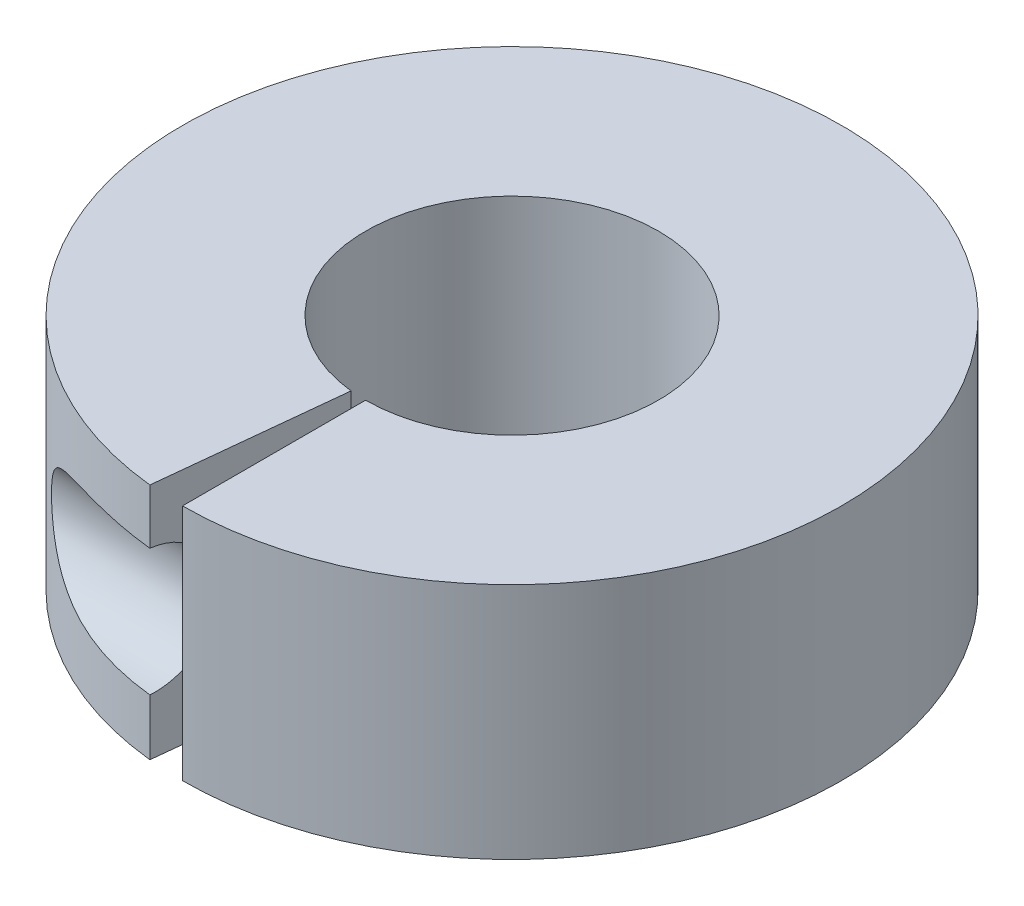
ISO-10303-21;
HEADER;
FILE_DESCRIPTION(('STEP AP214'),'2;1');
FILE_NAME('part.step','',(''),(''),'','','');
FILE_SCHEMA(('AUTOMOTIVE_DESIGN { 1 0 10303 214 1 1 1 1 }'));
ENDSEC;
DATA;
#1=APPLICATION_CONTEXT('core data for automotive mechanical design processes');
#2=APPLICATION_PROTOCOL_DEFINITION('international standard','automotive_design',2000,#1);
#3=PRODUCT_CONTEXT('',#1,'mechanical');
#4=PRODUCT('Part','Part','',(#3));
#5=PRODUCT_RELATED_PRODUCT_CATEGORY('part','',(#4));
#6=PRODUCT_DEFINITION_FORMATION('','',#4);
#7=PRODUCT_DEFINITION_CONTEXT('part definition',#1,'design');
#8=PRODUCT_DEFINITION('design','',#6,#7);
#9=PRODUCT_DEFINITION_SHAPE('','',#8);
#10=(LENGTH_UNIT() NAMED_UNIT(*) SI_UNIT(.MILLI.,.METRE.));
#11=(NAMED_UNIT(*) PLANE_ANGLE_UNIT() SI_UNIT($,.RADIAN.));
#12=(NAMED_UNIT(*) SI_UNIT($,.STERADIAN.) SOLID_ANGLE_UNIT());
#13=UNCERTAINTY_MEASURE_WITH_UNIT(LENGTH_MEASURE(1.E-05),#10,'distance_accuracy_value','');
#14=(GEOMETRIC_REPRESENTATION_CONTEXT(3) GLOBAL_UNCERTAINTY_ASSIGNED_CONTEXT((#13)) GLOBAL_UNIT_ASSIGNED_CONTEXT((#10,
#11,#12)) REPRESENTATION_CONTEXT('',''));
#15=CARTESIAN_POINT('',(0.,0.,0.));
#16=DIRECTION('',(0.,0.,1.));
#17=DIRECTION('',(1.,0.,0.));
#18=AXIS2_PLACEMENT_3D('',#15,#16,#17);
#19=CARTESIAN_POINT('',(0.,10.31875,0.));
#20=DIRECTION('',(0.,1.,0.));
#21=DIRECTION('',(0.,0.,1.));
#22=AXIS2_PLACEMENT_3D('',#19,#20,#21);
#23=PLANE('',#22);
#24=DIRECTION('',(-0.104528463267653,0.,0.994521895368273));
#25=VECTOR('',#24,1.);
#26=CARTESIAN_POINT('',(-0.6637557417496,10.31875,6.31521403558853));
#27=LINE('',#26,#25);
#28=CARTESIAN_POINT('',(-0.663755741749604,10.31875,6.31521403558853));
#29=VERTEX_POINT('',#28);
#30=CARTESIAN_POINT('',(-1.4934504189366,10.31875,14.2092315800742));
#31=VERTEX_POINT('',#30);
#32=EDGE_CURVE('E104',#29,#31,#27,.T.);
#33=ORIENTED_EDGE('',*,*,#32,.F.);
#34=CARTESIAN_POINT('',(0.,10.31875,0.));
#35=DIRECTION('',(0.,1.,0.));
#36=DIRECTION('',(0.,0.,1.));
#37=AXIS2_PLACEMENT_3D('',#34,#35,#36);
#38=CIRCLE('',#37,6.35);
#39=CARTESIAN_POINT('',(0.,10.31875,6.35));
#40=VERTEX_POINT('',#39);
#41=EDGE_CURVE('E109',#40,#29,#38,.T.);
#42=ORIENTED_EDGE('',*,*,#41,.F.);
#43=DIRECTION('',(0.,0.,-1.));
#44=VECTOR('',#43,1.);
#45=CARTESIAN_POINT('',(0.,10.31875,6.35));
#46=LINE('',#45,#44);
#47=CARTESIAN_POINT('',(0.,10.31875,14.2875));
#48=VERTEX_POINT('',#47);
#49=EDGE_CURVE('E205',#48,#40,#46,.T.);
#50=ORIENTED_EDGE('',*,*,#49,.F.);
#51=CARTESIAN_POINT('',(0.,10.31875,0.));
#52=DIRECTION('',(0.,1.,0.));
#53=DIRECTION('',(0.,0.,1.));
#54=AXIS2_PLACEMENT_3D('',#51,#52,#53);
#55=CIRCLE('',#54,14.2875);
#56=EDGE_CURVE('E89',#48,#31,#55,.T.);
#57=ORIENTED_EDGE('',*,*,#56,.T.);
#58=EDGE_LOOP('',(#33,#42,#50,#57));
#59=FACE_BOUND('',#58,.T.);
#60=ADVANCED_FACE('F39',(#59),#23,.T.);
#61=CARTESIAN_POINT('',(0.,0.,0.));
#62=DIRECTION('',(0.,1.,0.));
#63=DIRECTION('',(0.,0.,1.));
#64=AXIS2_PLACEMENT_3D('',#61,#62,#63);
#65=PLANE('',#64);
#66=CARTESIAN_POINT('',(0.,0.,0.));
#67=DIRECTION('',(0.,1.,0.));
#68=DIRECTION('',(0.,0.,1.));
#69=AXIS2_PLACEMENT_3D('',#66,#67,#68);
#70=CIRCLE('',#69,6.35);
#71=CARTESIAN_POINT('',(0.,0.,6.35));
#72=VERTEX_POINT('',#71);
#73=CARTESIAN_POINT('',(-0.663755741749604,0.,6.31521403558853));
#74=VERTEX_POINT('',#73);
#75=EDGE_CURVE('E115',#72,#74,#70,.T.);
#76=ORIENTED_EDGE('',*,*,#75,.T.);
#77=DIRECTION('',(-0.104528463267653,0.,0.994521895368273));
#78=VECTOR('',#77,1.);
#79=CARTESIAN_POINT('',(-0.6637557417496,0.,6.31521403558853));
#80=LINE('',#79,#78);
#81=CARTESIAN_POINT('',(-1.4934504189366,0.,14.2092315800742));
#82=VERTEX_POINT('',#81);
#83=EDGE_CURVE('E103',#74,#82,#80,.T.);
#84=ORIENTED_EDGE('',*,*,#83,.T.);
#85=CARTESIAN_POINT('',(0.,0.,0.));
#86=DIRECTION('',(0.,1.,0.));
#87=DIRECTION('',(0.,0.,1.));
#88=AXIS2_PLACEMENT_3D('',#85,#86,#87);
#89=CIRCLE('',#88,14.2875);
#90=CARTESIAN_POINT('',(0.,0.,14.2875));
#91=VERTEX_POINT('',#90);
#92=EDGE_CURVE('E87',#91,#82,#89,.T.);
#93=ORIENTED_EDGE('',*,*,#92,.F.);
#94=DIRECTION('',(0.,0.,-1.));
#95=VECTOR('',#94,1.);
#96=CARTESIAN_POINT('',(0.,0.,6.35));
#97=LINE('',#96,#95);
#98=EDGE_CURVE('E95',#91,#72,#97,.T.);
#99=ORIENTED_EDGE('',*,*,#98,.T.);
#100=EDGE_LOOP('',(#76,#84,#93,#99));
#101=FACE_BOUND('',#100,.T.);
#102=ADVANCED_FACE('F107',(#101),#65,.F.);
#103=CARTESIAN_POINT('',(0.,10.31875,0.));
#104=DIRECTION('',(0.,-1.,0.));
#105=DIRECTION('',(0.,0.,-1.));
#106=AXIS2_PLACEMENT_3D('',#103,#104,#105);
#107=CYLINDRICAL_SURFACE('',#106,14.2875);
#108=ORIENTED_EDGE('',*,*,#92,.T.);
#109=DIRECTION('',(0.,1.,0.));
#110=VECTOR('',#109,1.);
#111=CARTESIAN_POINT('',(-1.4934504189366,0.,14.2092315800742));
#112=LINE('',#111,#110);
#113=CARTESIAN_POINT('',(-1.4934504189366,2.43630016177887,14.2092315800742));
#114=VERTEX_POINT('',#113);
#115=EDGE_CURVE('E188',#82,#114,#112,.T.);
#116=ORIENTED_EDGE('',*,*,#115,.T.);
#117=CARTESIAN_POINT('',(0.,2.43518799899639,14.2875));
#118=CARTESIAN_POINT('',(-0.196336505388267,2.43522626136705,14.287502459682));
#119=CARTESIAN_POINT('',(-0.392672827958571,2.43518932541999,14.2834530510071));
#120=CARTESIAN_POINT('',(-0.78501652227577,2.43524017041919,14.2672680045718));
#121=CARTESIAN_POINT('',(-0.981023886143076,2.43532795431138,14.2551321758114));
#122=CARTESIAN_POINT('',(-1.37284324929985,2.43590406994694,14.2227528361699));
#123=CARTESIAN_POINT('',(-1.56865363989008,2.43639336630433,14.2024898602133));
#124=CARTESIAN_POINT('',(-1.95926367728492,2.43832192242183,14.1538925677908));
#125=CARTESIAN_POINT('',(-2.15406333622991,2.43976117074486,14.1255583485022));
#126=CARTESIAN_POINT('',(-2.54854796589378,2.44440858167978,14.0598299201523));
#127=CARTESIAN_POINT('',(-2.74818879080997,2.44767209635289,14.0221738527044));
#128=CARTESIAN_POINT('',(-3.14561748772692,2.45707347706137,13.9383996848902));
#129=CARTESIAN_POINT('',(-3.34340541772103,2.46321125282725,13.8922818503031));
#130=CARTESIAN_POINT('',(-3.73642488196423,2.47968376664615,13.7917682153464));
#131=CARTESIAN_POINT('',(-3.9316594125193,2.49001302330708,13.737383284109));
#132=CARTESIAN_POINT('',(-4.31924990619762,2.51649161637549,13.6204879857777));
#133=CARTESIAN_POINT('',(-4.51160651921118,2.53263961748689,13.5579794849978));
#134=CARTESIAN_POINT('',(-4.88974910509283,2.57241722224282,13.426185279214));
#135=CARTESIAN_POINT('',(-5.0755909538197,2.59592319740029,13.3570237800854));
#136=CARTESIAN_POINT('',(-5.44303381265776,2.65280691603915,13.2115508526591));
#137=CARTESIAN_POINT('',(-5.62463345703703,2.68618779263965,13.1352371603641));
#138=CARTESIAN_POINT('',(-5.98046592448732,2.76525875550508,12.9770644878873));
#139=CARTESIAN_POINT('',(-6.1547543061401,2.81082223658022,12.8952686873311));
#140=CARTESIAN_POINT('',(-6.49588522513086,2.91775987322536,12.7268300689859));
#141=CARTESIAN_POINT('',(-6.66273605989191,2.97911586487212,12.6401929085734));
#142=CARTESIAN_POINT('',(-6.95537099722593,3.10817165851765,12.4810930886774));
#143=CARTESIAN_POINT('',(-7.08290819449733,3.17241652198592,12.4090868513379));
#144=CARTESIAN_POINT('',(-7.32933120367261,3.31672312864701,12.2651503291084));
#145=CARTESIAN_POINT('',(-7.4482012937135,3.39681268245593,12.1932204045825));
#146=CARTESIAN_POINT('',(-7.6749191139143,3.57645699453041,12.0518173538936));
#147=CARTESIAN_POINT('',(-7.78262642033859,3.67622237428722,11.9823813806142));
#148=CARTESIAN_POINT('',(-7.98001744441912,3.89684556298222,11.8518310834624));
#149=CARTESIAN_POINT('',(-8.06975729245826,4.01763540872937,11.7906910422899));
#150=CARTESIAN_POINT('',(-8.19631308816605,4.23284609290068,11.702853805896));
#151=CARTESIAN_POINT('',(-8.2405457092596,4.32107621637753,11.6716855593509));
#152=CARTESIAN_POINT('',(-8.31662006383607,4.50514362783557,11.6176013892305));
#153=CARTESIAN_POINT('',(-8.34847060466156,4.60097545011222,11.594679600839));
#154=CARTESIAN_POINT('',(-8.39795477622407,4.7988834548608,11.5588916653572));
#155=CARTESIAN_POINT('',(-8.41548385865771,4.90099980613356,11.5460994860597));
#156=CARTESIAN_POINT('',(-8.43457037291047,5.10750298867355,11.5321651233197));
#157=CARTESIAN_POINT('',(-8.43613504331435,5.21188876941788,11.5310176599307));
#158=CARTESIAN_POINT('',(-8.42387288596192,5.40827888878753,11.5399763143496));
#159=CARTESIAN_POINT('',(-8.41162849949786,5.50044269667703,11.5489254584342));
#160=CARTESIAN_POINT('',(-8.37503811039647,5.68101029638654,11.5754869483903));
#161=CARTESIAN_POINT('',(-8.35069068633239,5.76941364523978,11.5931003118182));
#162=CARTESIAN_POINT('',(-8.29043013835937,5.94291589290777,11.6362716727227));
#163=CARTESIAN_POINT('',(-8.25422028466641,6.02785938277428,11.6620328395599));
#164=CARTESIAN_POINT('',(-8.17216965768959,6.190669723827,11.7196766461268));
#165=CARTESIAN_POINT('',(-8.1263241289619,6.26853305349448,11.7515623077745));
#166=CARTESIAN_POINT('',(-7.99732172518709,6.46036389916572,11.8399588284851));
#167=CARTESIAN_POINT('',(-7.90807468609977,6.56864627541153,11.8999265074418));
#168=CARTESIAN_POINT('',(-7.71493336883167,6.76705657995545,12.0260477580427));
#169=CARTESIAN_POINT('',(-7.61100136317461,6.85713624739186,12.0922171103158));
#170=CARTESIAN_POINT('',(-7.41451466873901,7.00459136347475,12.2134433510683));
#171=CARTESIAN_POINT('',(-7.32385076681926,7.06490347373108,12.2680713955341));
#172=CARTESIAN_POINT('',(-7.13716457640268,7.17636632289021,12.3776109899024));
#173=CARTESIAN_POINT('',(-7.04113893073328,7.22751123558598,12.432522697442));
#174=CARTESIAN_POINT('',(-6.84475562839349,7.32180799525252,12.5417151753006));
#175=CARTESIAN_POINT('',(-6.74439275171775,7.36494986019274,12.5959950795821));
#176=CARTESIAN_POINT('',(-6.54022139026463,7.444233763821,12.7032075188554));
#177=CARTESIAN_POINT('',(-6.43641160439428,7.48037312329031,12.756139531431));
#178=CARTESIAN_POINT('',(-6.13413848986329,7.57551147110742,12.9055495879459));
#179=CARTESIAN_POINT('',(-5.93213463037887,7.62693541734715,12.9997160869292));
#180=CARTESIAN_POINT('',(-5.52101452650004,7.71378657865407,13.1795887098799));
#181=CARTESIAN_POINT('',(-5.3118921498803,7.74919960591378,13.2652872777971));
#182=CARTESIAN_POINT('',(-4.88744699158083,7.80817193134774,13.4274852847809));
#183=CARTESIAN_POINT('',(-4.67210092086994,7.83167823156422,13.5039424609511));
#184=CARTESIAN_POINT('',(-4.23736386568459,7.86986049854964,13.6466019573843));
#185=CARTESIAN_POINT('',(-4.01797388949458,7.88453863659105,13.7128067962166));
#186=CARTESIAN_POINT('',(-3.64176175379775,7.90422242719199,13.8165178819876));
#187=CARTESIAN_POINT('',(-3.4857482614963,7.91080660907996,13.8567015983683));
#188=CARTESIAN_POINT('',(-3.17236463621944,7.92163794769589,13.9317880626581));
#189=CARTESIAN_POINT('',(-3.01499442974293,7.92588497698832,13.9666905225262));
#190=CARTESIAN_POINT('',(-2.69907073376496,7.93267672950823,14.0311680440448));
#191=CARTESIAN_POINT('',(-2.54051681592174,7.93522080297127,14.0607410691029));
#192=CARTESIAN_POINT('',(-2.22248421752124,7.93913220186248,14.1145042032177));
#193=CARTESIAN_POINT('',(-2.06300553110335,7.94049951982487,14.1386942781222));
#194=CARTESIAN_POINT('',(-1.74545903136191,7.94247439114498,14.181373294899));
#195=CARTESIAN_POINT('',(-1.58740095039631,7.94309188035417,14.1999342920272));
#196=CARTESIAN_POINT('',(-1.270751568253,7.94391951785905,14.2317661351393));
#197=CARTESIAN_POINT('',(-1.11216026556169,7.94412966499747,14.2450369660937));
#198=CARTESIAN_POINT('',(-0.794728793582914,7.94437747144386,14.2662660404374));
#199=CARTESIAN_POINT('',(-0.63588886104726,7.94441524578336,14.2742278237442));
#200=CARTESIAN_POINT('',(-0.318032638558107,7.94443710884899,14.284845318998));
#201=CARTESIAN_POINT('',(-0.159016349589901,7.94442119787355,14.2875010604415));
#202=CARTESIAN_POINT('',(0.,7.94443768817688,14.2875));
#203=B_SPLINE_CURVE_WITH_KNOTS('',3,(#117,#118,#119,#120,#121,#122,#123,#124,#125,#126,#127,
#128,#129,#130,#131,#132,#133,#134,#135,#136,#137,#138,#139,#140,#141,#142,#143,#144,#145,#146,
#147,#148,#149,#150,#151,#152,#153,#154,#155,#156,#157,#158,#159,#160,#161,#162,#163,#164,#165,
#166,#167,#168,#169,#170,#171,#172,#173,#174,#175,#176,#177,#178,#179,#180,#181,#182,#183,#184,
#185,#186,#187,#188,#189,#190,#191,#192,#193,#194,#195,#196,#197,#198,#199,#200,#201,#202),
.UNSPECIFIED.,.F.,.F.,(4,2,2,2,2,2,2,2,2,2,2,2,2,2,2,2,2,2,2,2,2,2,2,2,2,2,2,2,2,2,2,2,2,2,2,2,
2,2,2,2,2,2,4),(0.,0.58896747626181,1.17794886434074,1.76834940837035,2.35874284431726,
2.96810654908485,3.57745111736593,4.1860013727515,4.79441206575853,5.39310424187376,
5.99198657577533,6.58487201009108,7.17707855459499,7.65607539541888,8.1359205526238,
8.62121219048108,9.10496327240265,9.41433114366668,9.72347855794715,10.0348631115602,
10.3461064708902,10.6250084312054,10.9039431545687,11.1904691500013,11.4771368865431,
11.9323322827792,12.3887191461196,12.753693198777,13.1188983942921,13.4845560839238,
13.8503534022631,14.535388524127,15.2210294943104,15.9096960739929,16.5981932078885,
17.0818096968728,17.5654525529112,18.0492798383259,18.5331101933022,19.0104568726692,
19.4878049081715,19.9648343428608,20.4418611257071),.UNSPECIFIED.);
#204=CARTESIAN_POINT('',(-1.4934504189366,7.94332552539439,14.2092315800742));
#205=VERTEX_POINT('',#204);
#206=EDGE_CURVE('E49',#114,#205,#203,.T.);
#207=ORIENTED_EDGE('',*,*,#206,.T.);
#208=EDGE_CURVE('E56',#205,#31,#112,.T.);
#209=ORIENTED_EDGE('',*,*,#208,.T.);
#210=ORIENTED_EDGE('',*,*,#56,.F.);
#211=DIRECTION('',(0.,-1.,0.));
#212=VECTOR('',#211,1.);
#213=CARTESIAN_POINT('',(0.,10.31875,14.2875));
#214=LINE('',#213,#212);
#215=EDGE_CURVE('E84',#91,#48,#214,.F.);
#216=ORIENTED_EDGE('',*,*,#215,.F.);
#217=EDGE_LOOP('',(#108,#116,#207,#209,#210,#216));
#218=FACE_BOUND('',#217,.T.);
#219=ADVANCED_FACE('F41',(#218),#107,.T.);
#220=CARTESIAN_POINT('',(0.,10.31875,0.));
#221=DIRECTION('',(0.,-1.,0.));
#222=DIRECTION('',(0.,0.,-1.));
#223=AXIS2_PLACEMENT_3D('',#220,#221,#222);
#224=CYLINDRICAL_SURFACE('',#223,6.35);
#225=DIRECTION('',(0.,1.,0.));
#226=VECTOR('',#225,1.);
#227=CARTESIAN_POINT('',(-0.663755741749604,0.,6.31521403558853));
#228=LINE('',#227,#226);
#229=EDGE_CURVE('E195',#74,#29,#228,.T.);
#230=ORIENTED_EDGE('',*,*,#229,.F.);
#231=ORIENTED_EDGE('',*,*,#75,.F.);
#232=DIRECTION('',(0.,1.,0.));
#233=VECTOR('',#232,1.);
#234=CARTESIAN_POINT('',(0.,0.,6.35));
#235=LINE('',#234,#233);
#236=EDGE_CURVE('E98',#72,#40,#235,.T.);
#237=ORIENTED_EDGE('',*,*,#236,.T.);
#238=ORIENTED_EDGE('',*,*,#41,.T.);
#239=EDGE_LOOP('',(#230,#231,#237,#238));
#240=FACE_BOUND('',#239,.T.);
#241=ADVANCED_FACE('F130',(#240),#224,.F.);
#242=CARTESIAN_POINT('',(-10.31875,5.18981284358663,14.2875));
#243=DIRECTION('',(1.,0.,0.));
#244=DIRECTION('',(0.,0.,-1.));
#245=AXIS2_PLACEMENT_3D('',#242,#243,#244);
#246=CYLINDRICAL_SURFACE('',#245,2.75462484459024);
#247=ORIENTED_EDGE('',*,*,#206,.F.);
#248=CARTESIAN_POINT('',(-1.50167676135835,5.18981284358663,14.2875));
#249=DIRECTION('',(-0.994521895368273,0.,-0.104528463267654));
#250=DIRECTION('',(0.104528463267654,0.,-0.994521895368273));
#251=AXIS2_PLACEMENT_3D('',#248,#249,#250);
#252=ELLIPSE('',#251,2.76979808832685,2.75462484459024);
#253=EDGE_CURVE('E11',#114,#205,#252,.F.);
#254=ORIENTED_EDGE('',*,*,#253,.T.);
#255=EDGE_LOOP('',(#247,#254));
#256=FACE_BOUND('',#255,.T.);
#257=ADVANCED_FACE('F125',(#256),#246,.F.);
#258=CARTESIAN_POINT('',(0.,5.18981284358663,14.2875));
#259=DIRECTION('',(-1.,0.,0.));
#260=DIRECTION('',(0.,0.,1.));
#261=AXIS2_PLACEMENT_3D('',#258,#259,#260);
#262=PLANE('',#261);
#263=ORIENTED_EDGE('',*,*,#215,.T.);
#264=ORIENTED_EDGE('',*,*,#49,.T.);
#265=ORIENTED_EDGE('',*,*,#236,.F.);
#266=ORIENTED_EDGE('',*,*,#98,.F.);
#267=EDGE_LOOP('',(#263,#264,#265,#266));
#268=FACE_BOUND('',#267,.T.);
#269=ADVANCED_FACE('F96',(#268),#262,.T.);
#270=CARTESIAN_POINT('',(-0.6637557417496,0.,6.31521403558853));
#271=DIRECTION('',(-0.994521895368273,0.,-0.104528463267654));
#272=DIRECTION('',(-0.104528463267654,0.,0.994521895368273));
#273=AXIS2_PLACEMENT_3D('',#270,#271,#272);
#274=PLANE('',#273);
#275=ORIENTED_EDGE('',*,*,#115,.F.);
#276=ORIENTED_EDGE('',*,*,#83,.F.);
#277=ORIENTED_EDGE('',*,*,#229,.T.);
#278=ORIENTED_EDGE('',*,*,#32,.T.);
#279=ORIENTED_EDGE('',*,*,#208,.F.);
#280=ORIENTED_EDGE('',*,*,#253,.F.);
#281=EDGE_LOOP('',(#275,#276,#277,#278,#279,#280));
#282=FACE_BOUND('',#281,.T.);
#283=ADVANCED_FACE('F158',(#282),#274,.F.);
#284=CLOSED_SHELL('',(#60,#102,#219,#241,#257,#269,#283));
#285=MANIFOLD_SOLID_BREP('B2',#284);
#286=ADVANCED_BREP_SHAPE_REPRESENTATION('',(#18,#285),#14);
#287=SHAPE_DEFINITION_REPRESENTATION(#9,#286);
ENDSEC;
END-ISO-10303-21;
